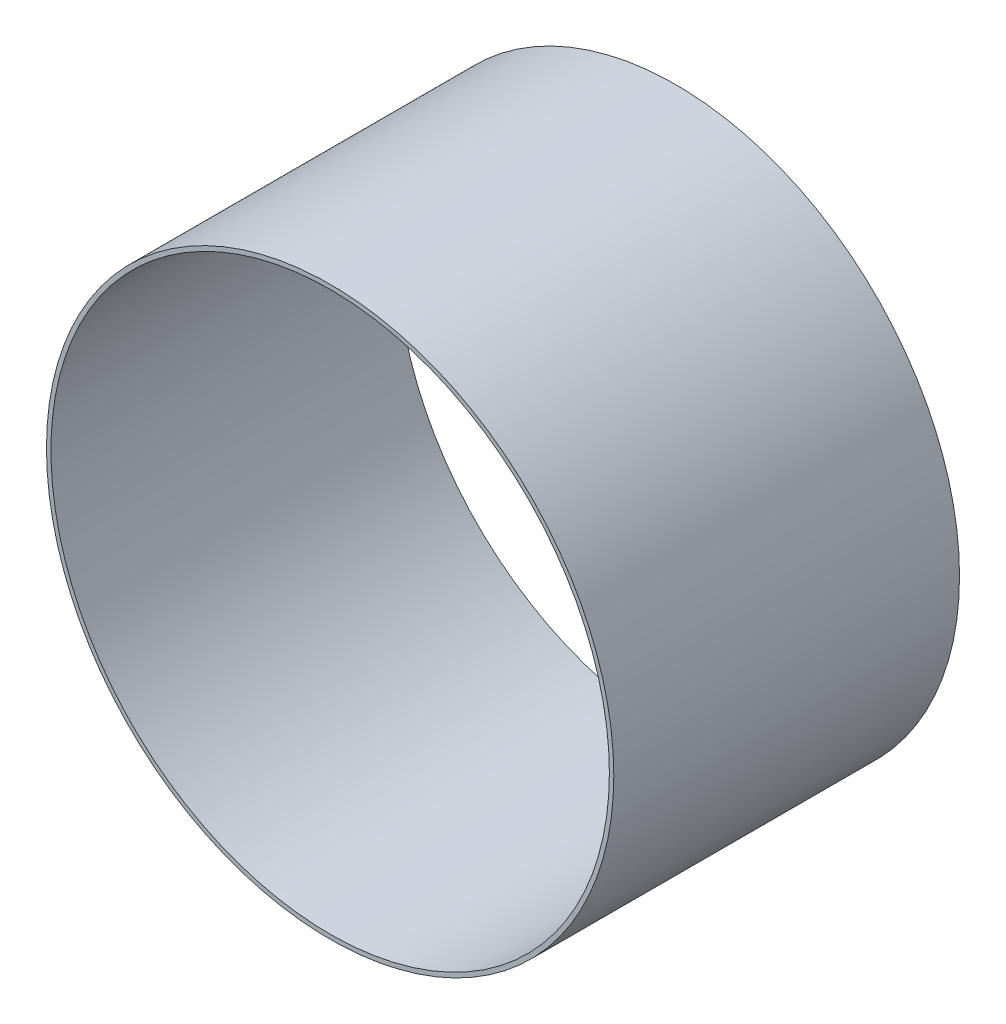
ISO-10303-21;
HEADER;
FILE_DESCRIPTION(('STEP AP214'),'2;1');
FILE_NAME('part.step','',(''),(''),'','','');
FILE_SCHEMA(('AUTOMOTIVE_DESIGN { 1 0 10303 214 1 1 1 1 }'));
ENDSEC;
DATA;
#1=APPLICATION_CONTEXT('core data for automotive mechanical design processes');
#2=APPLICATION_PROTOCOL_DEFINITION('international standard','automotive_design',2000,#1);
#3=PRODUCT_CONTEXT('',#1,'mechanical');
#4=PRODUCT('Part','Part','',(#3));
#5=PRODUCT_RELATED_PRODUCT_CATEGORY('part','',(#4));
#6=PRODUCT_DEFINITION_FORMATION('','',#4);
#7=PRODUCT_DEFINITION_CONTEXT('part definition',#1,'design');
#8=PRODUCT_DEFINITION('design','',#6,#7);
#9=PRODUCT_DEFINITION_SHAPE('','',#8);
#10=(LENGTH_UNIT() NAMED_UNIT(*) SI_UNIT(.MILLI.,.METRE.));
#11=(NAMED_UNIT(*) PLANE_ANGLE_UNIT() SI_UNIT($,.RADIAN.));
#12=(NAMED_UNIT(*) SI_UNIT($,.STERADIAN.) SOLID_ANGLE_UNIT());
#13=UNCERTAINTY_MEASURE_WITH_UNIT(LENGTH_MEASURE(1.E-05),#10,'distance_accuracy_value','');
#14=(GEOMETRIC_REPRESENTATION_CONTEXT(3) GLOBAL_UNCERTAINTY_ASSIGNED_CONTEXT((#13)) GLOBAL_UNIT_ASSIGNED_CONTEXT((#10,
#11,#12)) REPRESENTATION_CONTEXT('',''));
#15=CARTESIAN_POINT('',(0.,0.,0.));
#16=DIRECTION('',(0.,0.,1.));
#17=DIRECTION('',(1.,0.,0.));
#18=AXIS2_PLACEMENT_3D('',#15,#16,#17);
#19=CARTESIAN_POINT('',(0.,0.,51.8038671967513));
#20=DIRECTION('',(0.,0.,-1.));
#21=DIRECTION('',(-1.,0.,0.));
#22=AXIS2_PLACEMENT_3D('',#19,#20,#21);
#23=CYLINDRICAL_SURFACE('',#22,12.8);
#24=CARTESIAN_POINT('',(0.,0.,0.));
#25=DIRECTION('',(0.,0.,1.));
#26=DIRECTION('',(1.,0.,0.));
#27=AXIS2_PLACEMENT_3D('',#24,#25,#26);
#28=CIRCLE('',#27,12.8);
#29=CARTESIAN_POINT('',(12.8,0.,0.));
#30=VERTEX_POINT('',#29);
#31=EDGE_CURVE('E38',#30,#30,#28,.T.);
#32=ORIENTED_EDGE('',*,*,#31,.T.);
#33=EDGE_LOOP('',(#32));
#34=FACE_BOUND('',#33,.T.);
#35=CARTESIAN_POINT('',(0.,0.,15.6));
#36=DIRECTION('',(0.,0.,1.));
#37=DIRECTION('',(1.,0.,0.));
#38=AXIS2_PLACEMENT_3D('',#35,#36,#37);
#39=CIRCLE('',#38,12.8);
#40=CARTESIAN_POINT('',(12.8,0.,15.6));
#41=VERTEX_POINT('',#40);
#42=EDGE_CURVE('E10',#41,#41,#39,.T.);
#43=ORIENTED_EDGE('',*,*,#42,.F.);
#44=EDGE_LOOP('',(#43));
#45=FACE_BOUND('',#44,.T.);
#46=ADVANCED_FACE('F31',(#34,#45),#23,.T.);
#47=CARTESIAN_POINT('',(0.,0.,0.));
#48=DIRECTION('',(0.,0.,1.));
#49=DIRECTION('',(1.,0.,0.));
#50=AXIS2_PLACEMENT_3D('',#47,#48,#49);
#51=PLANE('',#50);
#52=ORIENTED_EDGE('',*,*,#31,.F.);
#53=EDGE_LOOP('',(#52));
#54=FACE_BOUND('',#53,.T.);
#55=CARTESIAN_POINT('',(0.,0.,0.));
#56=DIRECTION('',(0.,0.,1.));
#57=DIRECTION('',(1.,0.,0.));
#58=AXIS2_PLACEMENT_3D('',#55,#56,#57);
#59=CIRCLE('',#58,12.6);
#60=CARTESIAN_POINT('',(12.6,0.,0.));
#61=VERTEX_POINT('',#60);
#62=EDGE_CURVE('E43',#61,#61,#59,.T.);
#63=ORIENTED_EDGE('',*,*,#62,.T.);
#64=EDGE_LOOP('',(#63));
#65=FACE_BOUND('',#64,.T.);
#66=ADVANCED_FACE('F59',(#54,#65),#51,.F.);
#67=CARTESIAN_POINT('',(0.,0.,51.8038671967513));
#68=DIRECTION('',(0.,0.,-1.));
#69=DIRECTION('',(-1.,0.,0.));
#70=AXIS2_PLACEMENT_3D('',#67,#68,#69);
#71=CYLINDRICAL_SURFACE('',#70,12.6);
#72=ORIENTED_EDGE('',*,*,#62,.F.);
#73=EDGE_LOOP('',(#72));
#74=FACE_BOUND('',#73,.T.);
#75=CARTESIAN_POINT('',(0.,0.,15.6));
#76=DIRECTION('',(0.,0.,1.));
#77=DIRECTION('',(1.,0.,0.));
#78=AXIS2_PLACEMENT_3D('',#75,#76,#77);
#79=CIRCLE('',#78,12.6);
#80=CARTESIAN_POINT('',(12.6,0.,15.6));
#81=VERTEX_POINT('',#80);
#82=EDGE_CURVE('E34',#81,#81,#79,.T.);
#83=ORIENTED_EDGE('',*,*,#82,.T.);
#84=EDGE_LOOP('',(#83));
#85=FACE_BOUND('',#84,.T.);
#86=ADVANCED_FACE('F51',(#74,#85),#71,.F.);
#87=CARTESIAN_POINT('',(0.,0.,15.6));
#88=DIRECTION('',(0.,0.,1.));
#89=DIRECTION('',(0.958599231404933,0.284758693545733,0.));
#90=AXIS2_PLACEMENT_3D('',#87,#88,#89);
#91=PLANE('',#90);
#92=ORIENTED_EDGE('',*,*,#82,.F.);
#93=EDGE_LOOP('',(#92));
#94=FACE_BOUND('',#93,.T.);
#95=ORIENTED_EDGE('',*,*,#42,.T.);
#96=EDGE_LOOP('',(#95));
#97=FACE_BOUND('',#96,.T.);
#98=ADVANCED_FACE('F53',(#94,#97),#91,.T.);
#99=CLOSED_SHELL('',(#46,#66,#86,#98));
#100=MANIFOLD_SOLID_BREP('B2',#99);
#101=ADVANCED_BREP_SHAPE_REPRESENTATION('',(#18,#100),#14);
#102=SHAPE_DEFINITION_REPRESENTATION(#9,#101);
ENDSEC;
END-ISO-10303-21;
